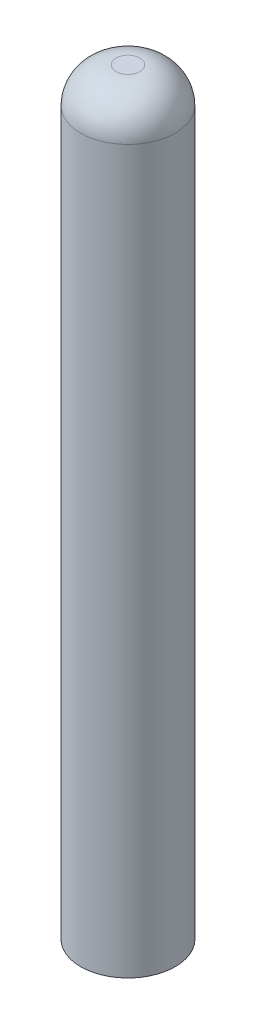
ISO-10303-21;
HEADER;
FILE_DESCRIPTION(('STEP AP214'),'2;1');
FILE_NAME('part.step','',(''),(''),'','','');
FILE_SCHEMA(('AUTOMOTIVE_DESIGN { 1 0 10303 214 1 1 1 1 }'));
ENDSEC;
DATA;
#1=APPLICATION_CONTEXT('core data for automotive mechanical design processes');
#2=APPLICATION_PROTOCOL_DEFINITION('international standard','automotive_design',2000,#1);
#3=PRODUCT_CONTEXT('',#1,'mechanical');
#4=PRODUCT('Part','Part','',(#3));
#5=PRODUCT_RELATED_PRODUCT_CATEGORY('part','',(#4));
#6=PRODUCT_DEFINITION_FORMATION('','',#4);
#7=PRODUCT_DEFINITION_CONTEXT('part definition',#1,'design');
#8=PRODUCT_DEFINITION('design','',#6,#7);
#9=PRODUCT_DEFINITION_SHAPE('','',#8);
#10=(LENGTH_UNIT() NAMED_UNIT(*) SI_UNIT(.MILLI.,.METRE.));
#11=(NAMED_UNIT(*) PLANE_ANGLE_UNIT() SI_UNIT($,.RADIAN.));
#12=(NAMED_UNIT(*) SI_UNIT($,.STERADIAN.) SOLID_ANGLE_UNIT());
#13=UNCERTAINTY_MEASURE_WITH_UNIT(LENGTH_MEASURE(1.E-05),#10,'distance_accuracy_value','');
#14=(GEOMETRIC_REPRESENTATION_CONTEXT(3) GLOBAL_UNCERTAINTY_ASSIGNED_CONTEXT((#13)) GLOBAL_UNIT_ASSIGNED_CONTEXT((#10,
#11,#12)) REPRESENTATION_CONTEXT('',''));
#15=CARTESIAN_POINT('',(0.,0.,0.));
#16=DIRECTION('',(0.,0.,1.));
#17=DIRECTION('',(1.,0.,0.));
#18=AXIS2_PLACEMENT_3D('',#15,#16,#17);
#19=CARTESIAN_POINT('',(0.,25.4,0.));
#20=DIRECTION('',(0.,-1.,0.));
#21=DIRECTION('',(0.,0.,-1.));
#22=AXIS2_PLACEMENT_3D('',#19,#20,#21);
#23=CYLINDRICAL_SURFACE('',#22,3.175);
#24=CARTESIAN_POINT('',(0.,23.01875,0.));
#25=DIRECTION('',(0.,1.,0.));
#26=DIRECTION('',(0.,0.,1.));
#27=AXIS2_PLACEMENT_3D('',#24,#25,#26);
#28=CIRCLE('',#27,3.175);
#29=CARTESIAN_POINT('',(0.,23.01875,3.175));
#30=VERTEX_POINT('',#29);
#31=EDGE_CURVE('E10',#30,#30,#28,.F.);
#32=ORIENTED_EDGE('',*,*,#31,.T.);
#33=EDGE_LOOP('',(#32));
#34=FACE_BOUND('',#33,.T.);
#35=CARTESIAN_POINT('',(0.,-25.4,0.));
#36=DIRECTION('',(0.,1.,0.));
#37=DIRECTION('',(0.,0.,1.));
#38=AXIS2_PLACEMENT_3D('',#35,#36,#37);
#39=CIRCLE('',#38,3.175);
#40=CARTESIAN_POINT('',(0.,-25.4,3.175));
#41=VERTEX_POINT('',#40);
#42=EDGE_CURVE('E41',#41,#41,#39,.T.);
#43=ORIENTED_EDGE('',*,*,#42,.T.);
#44=EDGE_LOOP('',(#43));
#45=FACE_BOUND('',#44,.T.);
#46=ADVANCED_FACE('F30',(#34,#45),#23,.T.);
#47=CARTESIAN_POINT('',(0.,25.4,0.));
#48=DIRECTION('',(0.,1.,0.));
#49=DIRECTION('',(0.,0.,1.));
#50=AXIS2_PLACEMENT_3D('',#47,#48,#49);
#51=PLANE('',#50);
#52=CARTESIAN_POINT('',(0.,25.4,0.));
#53=DIRECTION('',(0.,1.,0.));
#54=DIRECTION('',(0.,0.,1.));
#55=AXIS2_PLACEMENT_3D('',#52,#53,#54);
#56=CIRCLE('',#55,0.79375);
#57=CARTESIAN_POINT('',(0.,25.4,0.79375));
#58=VERTEX_POINT('',#57);
#59=EDGE_CURVE('E37',#58,#58,#56,.T.);
#60=ORIENTED_EDGE('',*,*,#59,.T.);
#61=EDGE_LOOP('',(#60));
#62=FACE_BOUND('',#61,.T.);
#63=ADVANCED_FACE('F51',(#62),#51,.T.);
#64=CARTESIAN_POINT('',(0.,-25.4,0.));
#65=DIRECTION('',(0.,1.,0.));
#66=DIRECTION('',(0.,0.,1.));
#67=AXIS2_PLACEMENT_3D('',#64,#65,#66);
#68=PLANE('',#67);
#69=ORIENTED_EDGE('',*,*,#42,.F.);
#70=EDGE_LOOP('',(#69));
#71=FACE_BOUND('',#70,.T.);
#72=ADVANCED_FACE('F49',(#71),#68,.F.);
#73=CARTESIAN_POINT('',(0.,23.01875,0.));
#74=DIRECTION('',(0.,1.,0.));
#75=DIRECTION('',(0.,0.,1.));
#76=AXIS2_PLACEMENT_3D('',#73,#74,#75);
#77=DEGENERATE_TOROIDAL_SURFACE('',#76,0.79375,2.38125,.T.);
#78=ORIENTED_EDGE('',*,*,#31,.F.);
#79=EDGE_LOOP('',(#78));
#80=FACE_BOUND('',#79,.T.);
#81=ORIENTED_EDGE('',*,*,#59,.F.);
#82=EDGE_LOOP('',(#81));
#83=FACE_BOUND('',#82,.T.);
#84=ADVANCED_FACE('F32',(#80,#83),#77,.T.);
#85=CLOSED_SHELL('',(#46,#63,#72,#84));
#86=MANIFOLD_SOLID_BREP('B2',#85);
#87=ADVANCED_BREP_SHAPE_REPRESENTATION('',(#18,#86),#14);
#88=SHAPE_DEFINITION_REPRESENTATION(#9,#87);
ENDSEC;
END-ISO-10303-21;
